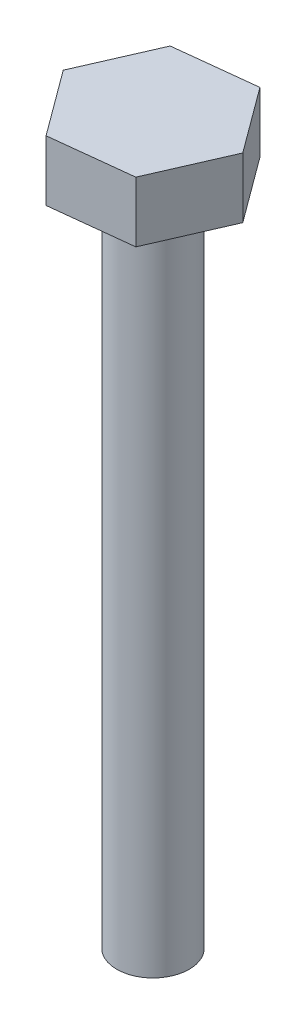
ISO-10303-21;
HEADER;
FILE_DESCRIPTION(('STEP AP214'),'2;1');
FILE_NAME('part.step','',(''),(''),'','','');
FILE_SCHEMA(('AUTOMOTIVE_DESIGN { 1 0 10303 214 1 1 1 1 }'));
ENDSEC;
DATA;
#1=APPLICATION_CONTEXT('core data for automotive mechanical design processes');
#2=APPLICATION_PROTOCOL_DEFINITION('international standard','automotive_design',2000,#1);
#3=PRODUCT_CONTEXT('',#1,'mechanical');
#4=PRODUCT('Part','Part','',(#3));
#5=PRODUCT_RELATED_PRODUCT_CATEGORY('part','',(#4));
#6=PRODUCT_DEFINITION_FORMATION('','',#4);
#7=PRODUCT_DEFINITION_CONTEXT('part definition',#1,'design');
#8=PRODUCT_DEFINITION('design','',#6,#7);
#9=PRODUCT_DEFINITION_SHAPE('','',#8);
#10=(LENGTH_UNIT() NAMED_UNIT(*) SI_UNIT(.MILLI.,.METRE.));
#11=(NAMED_UNIT(*) PLANE_ANGLE_UNIT() SI_UNIT($,.RADIAN.));
#12=(NAMED_UNIT(*) SI_UNIT($,.STERADIAN.) SOLID_ANGLE_UNIT());
#13=UNCERTAINTY_MEASURE_WITH_UNIT(LENGTH_MEASURE(1.E-05),#10,'distance_accuracy_value','');
#14=(GEOMETRIC_REPRESENTATION_CONTEXT(3) GLOBAL_UNCERTAINTY_ASSIGNED_CONTEXT((#13)) GLOBAL_UNIT_ASSIGNED_CONTEXT((#10,
#11,#12)) REPRESENTATION_CONTEXT('',''));
#15=CARTESIAN_POINT('',(0.,0.,0.));
#16=DIRECTION('',(0.,0.,1.));
#17=DIRECTION('',(1.,0.,0.));
#18=AXIS2_PLACEMENT_3D('',#15,#16,#17);
#19=CARTESIAN_POINT('',(-5.38475742306196,10.,12.3227268411438));
#20=DIRECTION('',(-0.111395090200419,0.,-0.993776199090741));
#21=DIRECTION('',(-0.993776199090741,0.,0.111395090200419));
#22=AXIS2_PLACEMENT_3D('',#19,#20,#21);
#23=PLANE('',#22);
#24=DIRECTION('',(0.993776199090741,0.,-0.111395090200419));
#25=VECTOR('',#24,1.);
#26=CARTESIAN_POINT('',(-5.38475742306196,0.,12.3227268411438));
#27=LINE('',#26,#25);
#28=CARTESIAN_POINT('',(-5.38475742306196,0.,12.3227268411438));
#29=VERTEX_POINT('',#28);
#30=CARTESIAN_POINT('',(7.97941577679593,0.,10.8247001421604));
#31=VERTEX_POINT('',#30);
#32=EDGE_CURVE('E119',#29,#31,#27,.T.);
#33=ORIENTED_EDGE('',*,*,#32,.T.);
#34=DIRECTION('',(0.,-1.,0.));
#35=VECTOR('',#34,1.);
#36=CARTESIAN_POINT('',(7.97941577679593,10.,10.8247001421604));
#37=LINE('',#36,#35);
#38=CARTESIAN_POINT('',(7.97941577679593,10.,10.8247001421604));
#39=VERTEX_POINT('',#38);
#40=EDGE_CURVE('E36',#39,#31,#37,.T.);
#41=ORIENTED_EDGE('',*,*,#40,.F.);
#42=DIRECTION('',(0.993776199090741,0.,-0.111395090200419));
#43=VECTOR('',#42,1.);
#44=CARTESIAN_POINT('',(-5.38475742306196,10.,12.3227268411438));
#45=LINE('',#44,#43);
#46=CARTESIAN_POINT('',(-5.38475742306196,10.,12.3227268411438));
#47=VERTEX_POINT('',#46);
#48=EDGE_CURVE('E130',#47,#39,#45,.T.);
#49=ORIENTED_EDGE('',*,*,#48,.F.);
#50=DIRECTION('',(0.,-1.,0.));
#51=VECTOR('',#50,1.);
#52=CARTESIAN_POINT('',(-5.38475742306196,10.,12.3227268411438));
#53=LINE('',#52,#51);
#54=EDGE_CURVE('E115',#47,#29,#53,.T.);
#55=ORIENTED_EDGE('',*,*,#54,.T.);
#56=EDGE_LOOP('',(#33,#41,#49,#55));
#57=FACE_BOUND('',#56,.T.);
#58=ADVANCED_FACE('F33',(#57),#23,.F.);
#59=CARTESIAN_POINT('',(7.97941577679593,10.,10.8247001421604));
#60=DIRECTION('',(-0.916332979189133,0.,-0.400417121574949));
#61=DIRECTION('',(-0.400417121574949,0.,0.916332979189133));
#62=AXIS2_PLACEMENT_3D('',#59,#60,#61);
#63=PLANE('',#62);
#64=DIRECTION('',(0.400417121574949,0.,-0.916332979189133));
#65=VECTOR('',#64,1.);
#66=CARTESIAN_POINT('',(7.97941577679593,0.,10.8247001421604));
#67=LINE('',#66,#65);
#68=CARTESIAN_POINT('',(13.3641731998579,0.,-1.49802669898342));
#69=VERTEX_POINT('',#68);
#70=EDGE_CURVE('E122',#31,#69,#67,.T.);
#71=ORIENTED_EDGE('',*,*,#70,.T.);
#72=DIRECTION('',(0.,-1.,0.));
#73=VECTOR('',#72,1.);
#74=CARTESIAN_POINT('',(13.3641731998579,10.,-1.49802669898342));
#75=LINE('',#74,#73);
#76=CARTESIAN_POINT('',(13.3641731998579,10.,-1.49802669898342));
#77=VERTEX_POINT('',#76);
#78=EDGE_CURVE('E133',#77,#69,#75,.T.);
#79=ORIENTED_EDGE('',*,*,#78,.F.);
#80=DIRECTION('',(0.400417121574949,0.,-0.916332979189133));
#81=VECTOR('',#80,1.);
#82=CARTESIAN_POINT('',(7.97941577679593,10.,10.8247001421604));
#83=LINE('',#82,#81);
#84=EDGE_CURVE('E88',#39,#77,#83,.T.);
#85=ORIENTED_EDGE('',*,*,#84,.F.);
#86=ORIENTED_EDGE('',*,*,#40,.T.);
#87=EDGE_LOOP('',(#71,#79,#85,#86));
#88=FACE_BOUND('',#87,.T.);
#89=ADVANCED_FACE('F138',(#88),#63,.F.);
#90=CARTESIAN_POINT('',(13.3641731998579,10.,-1.49802669898342));
#91=DIRECTION('',(-0.804937888988714,0.,0.593359077515792));
#92=DIRECTION('',(0.593359077515792,0.,0.804937888988715));
#93=AXIS2_PLACEMENT_3D('',#90,#91,#92);
#94=PLANE('',#93);
#95=DIRECTION('',(-0.593359077515792,0.,-0.804937888988714));
#96=VECTOR('',#95,1.);
#97=CARTESIAN_POINT('',(13.3641731998579,0.,-1.49802669898342));
#98=LINE('',#97,#96);
#99=CARTESIAN_POINT('',(5.38475742306197,0.,-12.3227268411438));
#100=VERTEX_POINT('',#99);
#101=EDGE_CURVE('E125',#69,#100,#98,.T.);
#102=ORIENTED_EDGE('',*,*,#101,.T.);
#103=DIRECTION('',(0.,-1.,0.));
#104=VECTOR('',#103,1.);
#105=CARTESIAN_POINT('',(5.38475742306197,10.,-12.3227268411438));
#106=LINE('',#105,#104);
#107=CARTESIAN_POINT('',(5.38475742306197,10.,-12.3227268411438));
#108=VERTEX_POINT('',#107);
#109=EDGE_CURVE('E110',#108,#100,#106,.T.);
#110=ORIENTED_EDGE('',*,*,#109,.F.);
#111=DIRECTION('',(-0.593359077515792,0.,-0.804937888988714));
#112=VECTOR('',#111,1.);
#113=CARTESIAN_POINT('',(13.3641731998579,10.,-1.49802669898342));
#114=LINE('',#113,#112);
#115=EDGE_CURVE('E101',#77,#108,#114,.T.);
#116=ORIENTED_EDGE('',*,*,#115,.F.);
#117=ORIENTED_EDGE('',*,*,#78,.T.);
#118=EDGE_LOOP('',(#102,#110,#116,#117));
#119=FACE_BOUND('',#118,.T.);
#120=ADVANCED_FACE('F144',(#119),#94,.F.);
#121=CARTESIAN_POINT('',(5.38475742306197,10.,-12.3227268411438));
#122=DIRECTION('',(0.111395090200419,0.,0.993776199090741));
#123=DIRECTION('',(0.993776199090741,0.,-0.111395090200419));
#124=AXIS2_PLACEMENT_3D('',#121,#122,#123);
#125=PLANE('',#124);
#126=DIRECTION('',(-0.993776199090741,0.,0.111395090200419));
#127=VECTOR('',#126,1.);
#128=CARTESIAN_POINT('',(5.38475742306197,0.,-12.3227268411438));
#129=LINE('',#128,#127);
#130=CARTESIAN_POINT('',(-7.97941577679593,0.,-10.8247001421604));
#131=VERTEX_POINT('',#130);
#132=EDGE_CURVE('E109',#100,#131,#129,.T.);
#133=ORIENTED_EDGE('',*,*,#132,.T.);
#134=DIRECTION('',(0.,-1.,0.));
#135=VECTOR('',#134,1.);
#136=CARTESIAN_POINT('',(-7.97941577679593,10.,-10.8247001421604));
#137=LINE('',#136,#135);
#138=CARTESIAN_POINT('',(-7.97941577679593,10.,-10.8247001421604));
#139=VERTEX_POINT('',#138);
#140=EDGE_CURVE('E106',#139,#131,#137,.T.);
#141=ORIENTED_EDGE('',*,*,#140,.F.);
#142=DIRECTION('',(-0.993776199090741,0.,0.111395090200419));
#143=VECTOR('',#142,1.);
#144=CARTESIAN_POINT('',(5.38475742306197,10.,-12.3227268411438));
#145=LINE('',#144,#143);
#146=EDGE_CURVE('E95',#108,#139,#145,.T.);
#147=ORIENTED_EDGE('',*,*,#146,.F.);
#148=ORIENTED_EDGE('',*,*,#109,.T.);
#149=EDGE_LOOP('',(#133,#141,#147,#148));
#150=FACE_BOUND('',#149,.T.);
#151=ADVANCED_FACE('F107',(#150),#125,.F.);
#152=CARTESIAN_POINT('',(-7.97941577679593,10.,-10.8247001421604));
#153=DIRECTION('',(0.916332979189133,0.,0.400417121574949));
#154=DIRECTION('',(0.400417121574949,0.,-0.916332979189133));
#155=AXIS2_PLACEMENT_3D('',#152,#153,#154);
#156=PLANE('',#155);
#157=DIRECTION('',(-0.400417121574949,0.,0.916332979189133));
#158=VECTOR('',#157,1.);
#159=CARTESIAN_POINT('',(-7.97941577679593,0.,-10.8247001421604));
#160=LINE('',#159,#158);
#161=CARTESIAN_POINT('',(-13.3641731998579,0.,1.49802669898342));
#162=VERTEX_POINT('',#161);
#163=EDGE_CURVE('E73',#131,#162,#160,.T.);
#164=ORIENTED_EDGE('',*,*,#163,.T.);
#165=DIRECTION('',(0.,-1.,0.));
#166=VECTOR('',#165,1.);
#167=CARTESIAN_POINT('',(-13.3641731998579,10.,1.49802669898342));
#168=LINE('',#167,#166);
#169=CARTESIAN_POINT('',(-13.3641731998579,10.,1.49802669898342));
#170=VERTEX_POINT('',#169);
#171=EDGE_CURVE('E111',#170,#162,#168,.T.);
#172=ORIENTED_EDGE('',*,*,#171,.F.);
#173=DIRECTION('',(-0.400417121574949,0.,0.916332979189133));
#174=VECTOR('',#173,1.);
#175=CARTESIAN_POINT('',(-7.97941577679593,10.,-10.8247001421604));
#176=LINE('',#175,#174);
#177=EDGE_CURVE('E99',#139,#170,#176,.T.);
#178=ORIENTED_EDGE('',*,*,#177,.F.);
#179=ORIENTED_EDGE('',*,*,#140,.T.);
#180=EDGE_LOOP('',(#164,#172,#178,#179));
#181=FACE_BOUND('',#180,.T.);
#182=ADVANCED_FACE('F113',(#181),#156,.F.);
#183=CARTESIAN_POINT('',(-13.3641731998579,10.,1.49802669898342));
#184=DIRECTION('',(0.804937888988715,0.,-0.593359077515792));
#185=DIRECTION('',(-0.593359077515792,0.,-0.804937888988715));
#186=AXIS2_PLACEMENT_3D('',#183,#184,#185);
#187=PLANE('',#186);
#188=DIRECTION('',(0.593359077515792,0.,0.804937888988715));
#189=VECTOR('',#188,1.);
#190=CARTESIAN_POINT('',(-13.3641731998579,0.,1.49802669898342));
#191=LINE('',#190,#189);
#192=EDGE_CURVE('E79',#162,#29,#191,.T.);
#193=ORIENTED_EDGE('',*,*,#192,.T.);
#194=ORIENTED_EDGE('',*,*,#54,.F.);
#195=DIRECTION('',(0.593359077515792,0.,0.804937888988715));
#196=VECTOR('',#195,1.);
#197=CARTESIAN_POINT('',(-13.3641731998579,10.,1.49802669898342));
#198=LINE('',#197,#196);
#199=EDGE_CURVE('E50',#170,#47,#198,.T.);
#200=ORIENTED_EDGE('',*,*,#199,.F.);
#201=ORIENTED_EDGE('',*,*,#171,.T.);
#202=EDGE_LOOP('',(#193,#194,#200,#201));
#203=FACE_BOUND('',#202,.T.);
#204=ADVANCED_FACE('F164',(#203),#187,.F.);
#205=CARTESIAN_POINT('',(0.,10.,0.));
#206=DIRECTION('',(0.,1.,0.));
#207=DIRECTION('',(0.,0.,1.));
#208=AXIS2_PLACEMENT_3D('',#205,#206,#207);
#209=PLANE('',#208);
#210=ORIENTED_EDGE('',*,*,#48,.T.);
#211=ORIENTED_EDGE('',*,*,#84,.T.);
#212=ORIENTED_EDGE('',*,*,#115,.T.);
#213=ORIENTED_EDGE('',*,*,#146,.T.);
#214=ORIENTED_EDGE('',*,*,#177,.T.);
#215=ORIENTED_EDGE('',*,*,#199,.T.);
#216=EDGE_LOOP('',(#210,#211,#212,#213,#214,#215));
#217=FACE_BOUND('',#216,.T.);
#218=ADVANCED_FACE('F97',(#217),#209,.T.);
#219=CARTESIAN_POINT('',(0.,0.,0.));
#220=DIRECTION('',(0.,1.,0.));
#221=DIRECTION('',(0.,0.,1.));
#222=AXIS2_PLACEMENT_3D('',#219,#220,#221);
#223=PLANE('',#222);
#224=CARTESIAN_POINT('',(0.,0.,0.));
#225=DIRECTION('',(0.,-1.,0.));
#226=DIRECTION('',(0.,0.,-1.));
#227=AXIS2_PLACEMENT_3D('',#224,#225,#226);
#228=CIRCLE('',#227,6.);
#229=CARTESIAN_POINT('',(0.,0.,-6.));
#230=VERTEX_POINT('',#229);
#231=EDGE_CURVE('E11',#230,#230,#228,.T.);
#232=ORIENTED_EDGE('',*,*,#231,.F.);
#233=EDGE_LOOP('',(#232));
#234=FACE_BOUND('',#233,.T.);
#235=ORIENTED_EDGE('',*,*,#32,.F.);
#236=ORIENTED_EDGE('',*,*,#192,.F.);
#237=ORIENTED_EDGE('',*,*,#163,.F.);
#238=ORIENTED_EDGE('',*,*,#132,.F.);
#239=ORIENTED_EDGE('',*,*,#101,.F.);
#240=ORIENTED_EDGE('',*,*,#70,.F.);
#241=EDGE_LOOP('',(#235,#236,#237,#238,#239,#240));
#242=FACE_BOUND('',#241,.T.);
#243=ADVANCED_FACE('F143',(#234,#242),#223,.F.);
#244=CARTESIAN_POINT('',(0.,-110.,0.));
#245=DIRECTION('',(0.,1.,0.));
#246=DIRECTION('',(0.,0.,1.));
#247=AXIS2_PLACEMENT_3D('',#244,#245,#246);
#248=CYLINDRICAL_SURFACE('',#247,6.);
#249=CARTESIAN_POINT('',(0.,-110.,0.));
#250=DIRECTION('',(0.,-1.,0.));
#251=DIRECTION('',(0.,0.,-1.));
#252=AXIS2_PLACEMENT_3D('',#249,#250,#251);
#253=CIRCLE('',#252,6.);
#254=CARTESIAN_POINT('',(0.,-110.,-6.));
#255=VERTEX_POINT('',#254);
#256=EDGE_CURVE('E123',#255,#255,#253,.T.);
#257=ORIENTED_EDGE('',*,*,#256,.F.);
#258=EDGE_LOOP('',(#257));
#259=FACE_BOUND('',#258,.T.);
#260=ORIENTED_EDGE('',*,*,#231,.T.);
#261=EDGE_LOOP('',(#260));
#262=FACE_BOUND('',#261,.T.);
#263=ADVANCED_FACE('F153',(#259,#262),#248,.T.);
#264=CARTESIAN_POINT('',(0.,-110.,0.));
#265=DIRECTION('',(0.,-1.,0.));
#266=DIRECTION('',(0.,0.,-1.));
#267=AXIS2_PLACEMENT_3D('',#264,#265,#266);
#268=PLANE('',#267);
#269=ORIENTED_EDGE('',*,*,#256,.T.);
#270=EDGE_LOOP('',(#269));
#271=FACE_BOUND('',#270,.T.);
#272=ADVANCED_FACE('F151',(#271),#268,.T.);
#273=CLOSED_SHELL('',(#58,#89,#120,#151,#182,#204,#218,#243,#263,#272));
#274=MANIFOLD_SOLID_BREP('B2',#273);
#275=ADVANCED_BREP_SHAPE_REPRESENTATION('',(#18,#274),#14);
#276=SHAPE_DEFINITION_REPRESENTATION(#9,#275);
ENDSEC;
END-ISO-10303-21;
